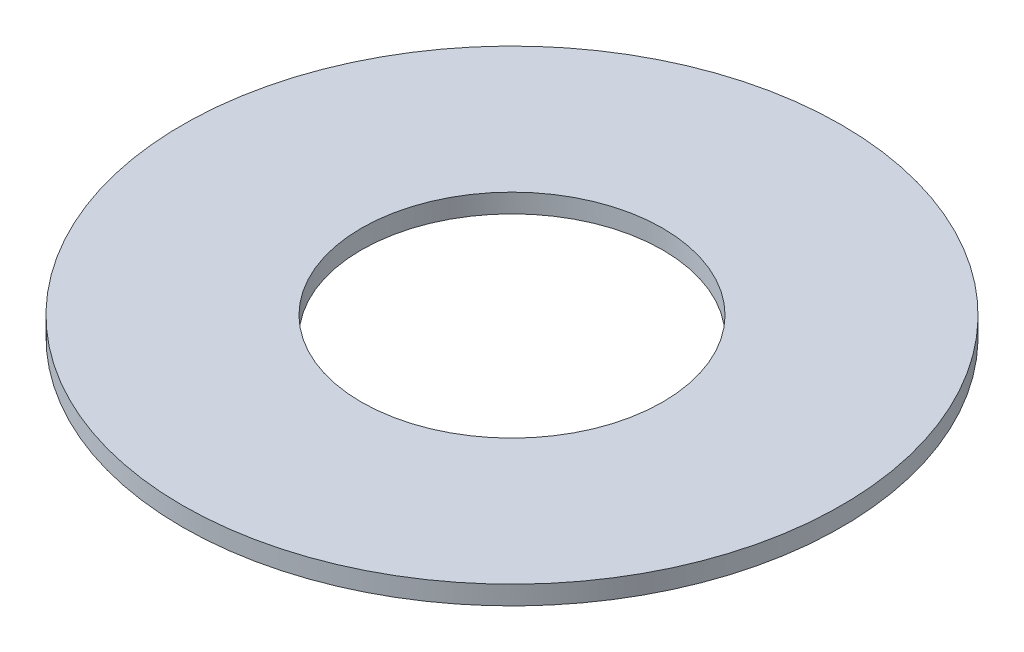
ISO-10303-21;
HEADER;
FILE_DESCRIPTION(('STEP AP214'),'2;1');
FILE_NAME('part.step','',(''),(''),'','','');
FILE_SCHEMA(('AUTOMOTIVE_DESIGN { 1 0 10303 214 1 1 1 1 }'));
ENDSEC;
DATA;
#1=APPLICATION_CONTEXT('core data for automotive mechanical design processes');
#2=APPLICATION_PROTOCOL_DEFINITION('international standard','automotive_design',2000,#1);
#3=PRODUCT_CONTEXT('',#1,'mechanical');
#4=PRODUCT('Part','Part','',(#3));
#5=PRODUCT_RELATED_PRODUCT_CATEGORY('part','',(#4));
#6=PRODUCT_DEFINITION_FORMATION('','',#4);
#7=PRODUCT_DEFINITION_CONTEXT('part definition',#1,'design');
#8=PRODUCT_DEFINITION('design','',#6,#7);
#9=PRODUCT_DEFINITION_SHAPE('','',#8);
#10=(LENGTH_UNIT() NAMED_UNIT(*) SI_UNIT(.MILLI.,.METRE.));
#11=(NAMED_UNIT(*) PLANE_ANGLE_UNIT() SI_UNIT($,.RADIAN.));
#12=(NAMED_UNIT(*) SI_UNIT($,.STERADIAN.) SOLID_ANGLE_UNIT());
#13=UNCERTAINTY_MEASURE_WITH_UNIT(LENGTH_MEASURE(1.E-05),#10,'distance_accuracy_value','');
#14=(GEOMETRIC_REPRESENTATION_CONTEXT(3) GLOBAL_UNCERTAINTY_ASSIGNED_CONTEXT((#13)) GLOBAL_UNIT_ASSIGNED_CONTEXT((#10,
#11,#12)) REPRESENTATION_CONTEXT('',''));
#15=CARTESIAN_POINT('',(0.,0.,0.));
#16=DIRECTION('',(0.,0.,1.));
#17=DIRECTION('',(1.,0.,0.));
#18=AXIS2_PLACEMENT_3D('',#15,#16,#17);
#19=CARTESIAN_POINT('',(0.,0.2,0.));
#20=DIRECTION('',(0.,1.,0.));
#21=DIRECTION('',(0.,0.,1.));
#22=AXIS2_PLACEMENT_3D('',#19,#20,#21);
#23=PLANE('',#22);
#24=CARTESIAN_POINT('',(0.,0.2,0.));
#25=DIRECTION('',(0.,1.,0.));
#26=DIRECTION('',(0.,0.,1.));
#27=AXIS2_PLACEMENT_3D('',#24,#25,#26);
#28=CIRCLE('',#27,3.5);
#29=CARTESIAN_POINT('',(0.,0.2,3.5));
#30=VERTEX_POINT('',#29);
#31=EDGE_CURVE('E10',#30,#30,#28,.T.);
#32=ORIENTED_EDGE('',*,*,#31,.T.);
#33=EDGE_LOOP('',(#32));
#34=FACE_BOUND('',#33,.T.);
#35=CARTESIAN_POINT('',(0.,0.2,0.));
#36=DIRECTION('',(0.,1.,0.));
#37=DIRECTION('',(0.,0.,1.));
#38=AXIS2_PLACEMENT_3D('',#35,#36,#37);
#39=CIRCLE('',#38,1.59999999999999);
#40=CARTESIAN_POINT('',(0.,0.2,1.59999999999999));
#41=VERTEX_POINT('',#40);
#42=EDGE_CURVE('E41',#41,#41,#39,.T.);
#43=ORIENTED_EDGE('',*,*,#42,.F.);
#44=EDGE_LOOP('',(#43));
#45=FACE_BOUND('',#44,.T.);
#46=ADVANCED_FACE('F30',(#34,#45),#23,.T.);
#47=CARTESIAN_POINT('',(0.,0.,0.));
#48=DIRECTION('',(0.,1.,0.));
#49=DIRECTION('',(0.,0.,1.));
#50=AXIS2_PLACEMENT_3D('',#47,#48,#49);
#51=PLANE('',#50);
#52=CARTESIAN_POINT('',(0.,0.,0.));
#53=DIRECTION('',(0.,1.,0.));
#54=DIRECTION('',(0.,0.,1.));
#55=AXIS2_PLACEMENT_3D('',#52,#53,#54);
#56=CIRCLE('',#55,3.5);
#57=CARTESIAN_POINT('',(0.,0.,3.5));
#58=VERTEX_POINT('',#57);
#59=EDGE_CURVE('E34',#58,#58,#56,.T.);
#60=ORIENTED_EDGE('',*,*,#59,.F.);
#61=EDGE_LOOP('',(#60));
#62=FACE_BOUND('',#61,.T.);
#63=CARTESIAN_POINT('',(0.,0.,0.));
#64=DIRECTION('',(0.,1.,0.));
#65=DIRECTION('',(0.,0.,1.));
#66=AXIS2_PLACEMENT_3D('',#63,#64,#65);
#67=CIRCLE('',#66,1.59999999999999);
#68=CARTESIAN_POINT('',(0.,0.,1.59999999999999));
#69=VERTEX_POINT('',#68);
#70=EDGE_CURVE('E43',#69,#69,#67,.T.);
#71=ORIENTED_EDGE('',*,*,#70,.T.);
#72=EDGE_LOOP('',(#71));
#73=FACE_BOUND('',#72,.T.);
#74=ADVANCED_FACE('F53',(#62,#73),#51,.F.);
#75=CARTESIAN_POINT('',(0.,0.2,0.));
#76=DIRECTION('',(0.,-1.,0.));
#77=DIRECTION('',(0.,0.,-1.));
#78=AXIS2_PLACEMENT_3D('',#75,#76,#77);
#79=CYLINDRICAL_SURFACE('',#78,3.5);
#80=ORIENTED_EDGE('',*,*,#31,.F.);
#81=EDGE_LOOP('',(#80));
#82=FACE_BOUND('',#81,.T.);
#83=ORIENTED_EDGE('',*,*,#59,.T.);
#84=EDGE_LOOP('',(#83));
#85=FACE_BOUND('',#84,.T.);
#86=ADVANCED_FACE('F32',(#82,#85),#79,.T.);
#87=CARTESIAN_POINT('',(0.,0.2,0.));
#88=DIRECTION('',(0.,-1.,0.));
#89=DIRECTION('',(0.,0.,-1.));
#90=AXIS2_PLACEMENT_3D('',#87,#88,#89);
#91=CYLINDRICAL_SURFACE('',#90,1.59999999999999);
#92=ORIENTED_EDGE('',*,*,#42,.T.);
#93=EDGE_LOOP('',(#92));
#94=FACE_BOUND('',#93,.T.);
#95=ORIENTED_EDGE('',*,*,#70,.F.);
#96=EDGE_LOOP('',(#95));
#97=FACE_BOUND('',#96,.T.);
#98=ADVANCED_FACE('F49',(#94,#97),#91,.F.);
#99=CLOSED_SHELL('',(#46,#74,#86,#98));
#100=MANIFOLD_SOLID_BREP('B2',#99);
#101=ADVANCED_BREP_SHAPE_REPRESENTATION('',(#18,#100),#14);
#102=SHAPE_DEFINITION_REPRESENTATION(#9,#101);
ENDSEC;
END-ISO-10303-21;
